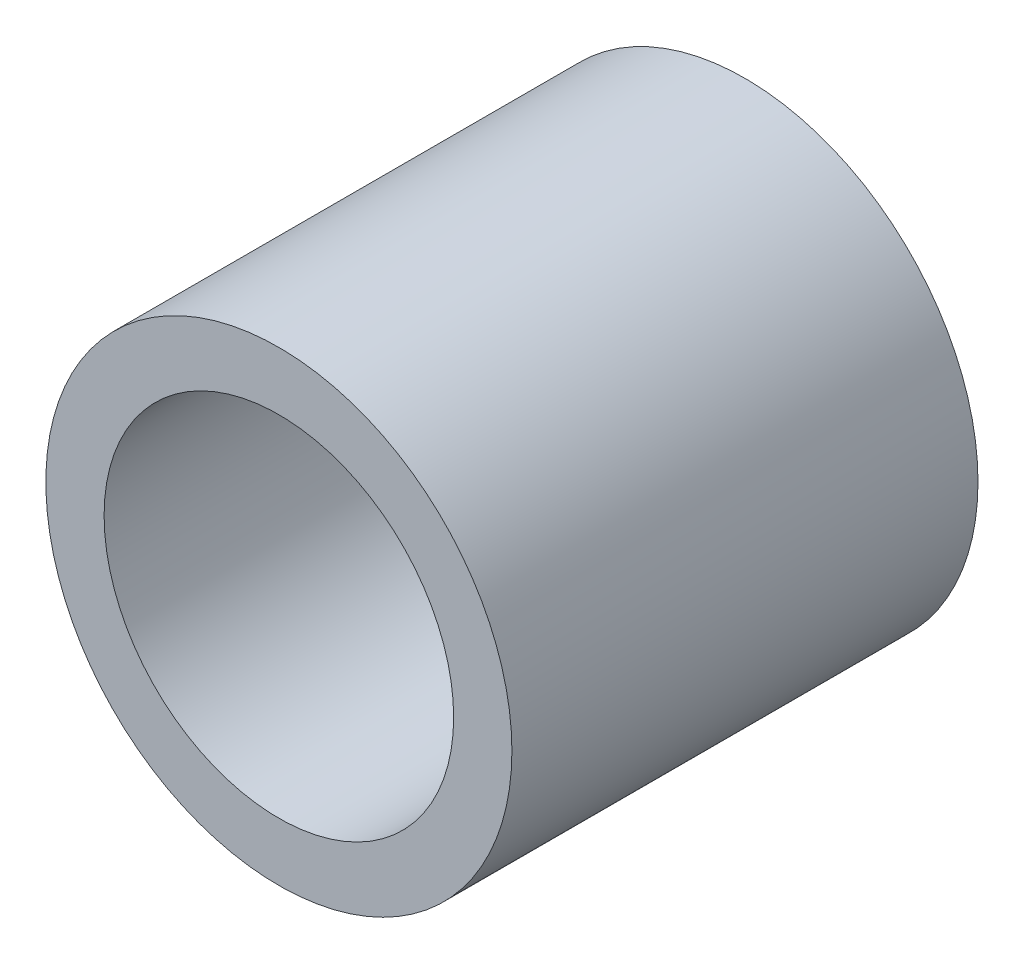
ISO-10303-21;
HEADER;
FILE_DESCRIPTION(('STEP AP214'),'2;1');
FILE_NAME('part.step','',(''),(''),'','','');
FILE_SCHEMA(('AUTOMOTIVE_DESIGN { 1 0 10303 214 1 1 1 1 }'));
ENDSEC;
DATA;
#1=APPLICATION_CONTEXT('core data for automotive mechanical design processes');
#2=APPLICATION_PROTOCOL_DEFINITION('international standard','automotive_design',2000,#1);
#3=PRODUCT_CONTEXT('',#1,'mechanical');
#4=PRODUCT('Part','Part','',(#3));
#5=PRODUCT_RELATED_PRODUCT_CATEGORY('part','',(#4));
#6=PRODUCT_DEFINITION_FORMATION('','',#4);
#7=PRODUCT_DEFINITION_CONTEXT('part definition',#1,'design');
#8=PRODUCT_DEFINITION('design','',#6,#7);
#9=PRODUCT_DEFINITION_SHAPE('','',#8);
#10=(LENGTH_UNIT() NAMED_UNIT(*) SI_UNIT(.MILLI.,.METRE.));
#11=(NAMED_UNIT(*) PLANE_ANGLE_UNIT() SI_UNIT($,.RADIAN.));
#12=(NAMED_UNIT(*) SI_UNIT($,.STERADIAN.) SOLID_ANGLE_UNIT());
#13=UNCERTAINTY_MEASURE_WITH_UNIT(LENGTH_MEASURE(1.E-05),#10,'distance_accuracy_value','');
#14=(GEOMETRIC_REPRESENTATION_CONTEXT(3) GLOBAL_UNCERTAINTY_ASSIGNED_CONTEXT((#13)) GLOBAL_UNIT_ASSIGNED_CONTEXT((#10,
#11,#12)) REPRESENTATION_CONTEXT('',''));
#15=CARTESIAN_POINT('',(0.,0.,0.));
#16=DIRECTION('',(0.,0.,1.));
#17=DIRECTION('',(1.,0.,0.));
#18=AXIS2_PLACEMENT_3D('',#15,#16,#17);
#19=CARTESIAN_POINT('',(0.,0.,4.));
#20=DIRECTION('',(0.,0.,1.));
#21=DIRECTION('',(1.,0.,0.));
#22=AXIS2_PLACEMENT_3D('',#19,#20,#21);
#23=PLANE('',#22);
#24=CARTESIAN_POINT('',(0.,0.,4.));
#25=DIRECTION('',(0.,0.,1.));
#26=DIRECTION('',(1.,0.,0.));
#27=AXIS2_PLACEMENT_3D('',#24,#25,#26);
#28=CIRCLE('',#27,2.);
#29=CARTESIAN_POINT('',(2.,0.,4.));
#30=VERTEX_POINT('',#29);
#31=EDGE_CURVE('E10',#30,#30,#28,.T.);
#32=ORIENTED_EDGE('',*,*,#31,.T.);
#33=EDGE_LOOP('',(#32));
#34=FACE_BOUND('',#33,.T.);
#35=CARTESIAN_POINT('',(0.,0.,4.));
#36=DIRECTION('',(0.,0.,1.));
#37=DIRECTION('',(1.,0.,0.));
#38=AXIS2_PLACEMENT_3D('',#35,#36,#37);
#39=CIRCLE('',#38,1.5);
#40=CARTESIAN_POINT('',(1.5,0.,4.));
#41=VERTEX_POINT('',#40);
#42=EDGE_CURVE('E43',#41,#41,#39,.T.);
#43=ORIENTED_EDGE('',*,*,#42,.F.);
#44=EDGE_LOOP('',(#43));
#45=FACE_BOUND('',#44,.T.);
#46=ADVANCED_FACE('F32',(#34,#45),#23,.T.);
#47=CARTESIAN_POINT('',(0.,0.,0.));
#48=DIRECTION('',(0.,0.,1.));
#49=DIRECTION('',(1.,0.,0.));
#50=AXIS2_PLACEMENT_3D('',#47,#48,#49);
#51=PLANE('',#50);
#52=CARTESIAN_POINT('',(0.,0.,0.));
#53=DIRECTION('',(0.,0.,1.));
#54=DIRECTION('',(1.,0.,0.));
#55=AXIS2_PLACEMENT_3D('',#52,#53,#54);
#56=CIRCLE('',#55,2.);
#57=CARTESIAN_POINT('',(2.,0.,0.));
#58=VERTEX_POINT('',#57);
#59=EDGE_CURVE('E36',#58,#58,#56,.T.);
#60=ORIENTED_EDGE('',*,*,#59,.F.);
#61=EDGE_LOOP('',(#60));
#62=FACE_BOUND('',#61,.T.);
#63=CARTESIAN_POINT('',(0.,0.,0.));
#64=DIRECTION('',(0.,0.,1.));
#65=DIRECTION('',(1.,0.,0.));
#66=AXIS2_PLACEMENT_3D('',#63,#64,#65);
#67=CIRCLE('',#66,1.5);
#68=CARTESIAN_POINT('',(1.5,0.,0.));
#69=VERTEX_POINT('',#68);
#70=EDGE_CURVE('E45',#69,#69,#67,.T.);
#71=ORIENTED_EDGE('',*,*,#70,.T.);
#72=EDGE_LOOP('',(#71));
#73=FACE_BOUND('',#72,.T.);
#74=ADVANCED_FACE('F55',(#62,#73),#51,.F.);
#75=CARTESIAN_POINT('',(0.,0.,4.));
#76=DIRECTION('',(0.,0.,-1.));
#77=DIRECTION('',(-1.,0.,0.));
#78=AXIS2_PLACEMENT_3D('',#75,#76,#77);
#79=CYLINDRICAL_SURFACE('',#78,2.);
#80=ORIENTED_EDGE('',*,*,#31,.F.);
#81=EDGE_LOOP('',(#80));
#82=FACE_BOUND('',#81,.T.);
#83=ORIENTED_EDGE('',*,*,#59,.T.);
#84=EDGE_LOOP('',(#83));
#85=FACE_BOUND('',#84,.T.);
#86=ADVANCED_FACE('F34',(#82,#85),#79,.T.);
#87=CARTESIAN_POINT('',(0.,0.,4.));
#88=DIRECTION('',(0.,0.,-1.));
#89=DIRECTION('',(-1.,0.,0.));
#90=AXIS2_PLACEMENT_3D('',#87,#88,#89);
#91=CYLINDRICAL_SURFACE('',#90,1.5);
#92=ORIENTED_EDGE('',*,*,#42,.T.);
#93=EDGE_LOOP('',(#92));
#94=FACE_BOUND('',#93,.T.);
#95=ORIENTED_EDGE('',*,*,#70,.F.);
#96=EDGE_LOOP('',(#95));
#97=FACE_BOUND('',#96,.T.);
#98=ADVANCED_FACE('F51',(#94,#97),#91,.F.);
#99=CLOSED_SHELL('',(#46,#74,#86,#98));
#100=MANIFOLD_SOLID_BREP('B2',#99);
#101=ADVANCED_BREP_SHAPE_REPRESENTATION('',(#18,#100),#14);
#102=SHAPE_DEFINITION_REPRESENTATION(#9,#101);
ENDSEC;
END-ISO-10303-21;
